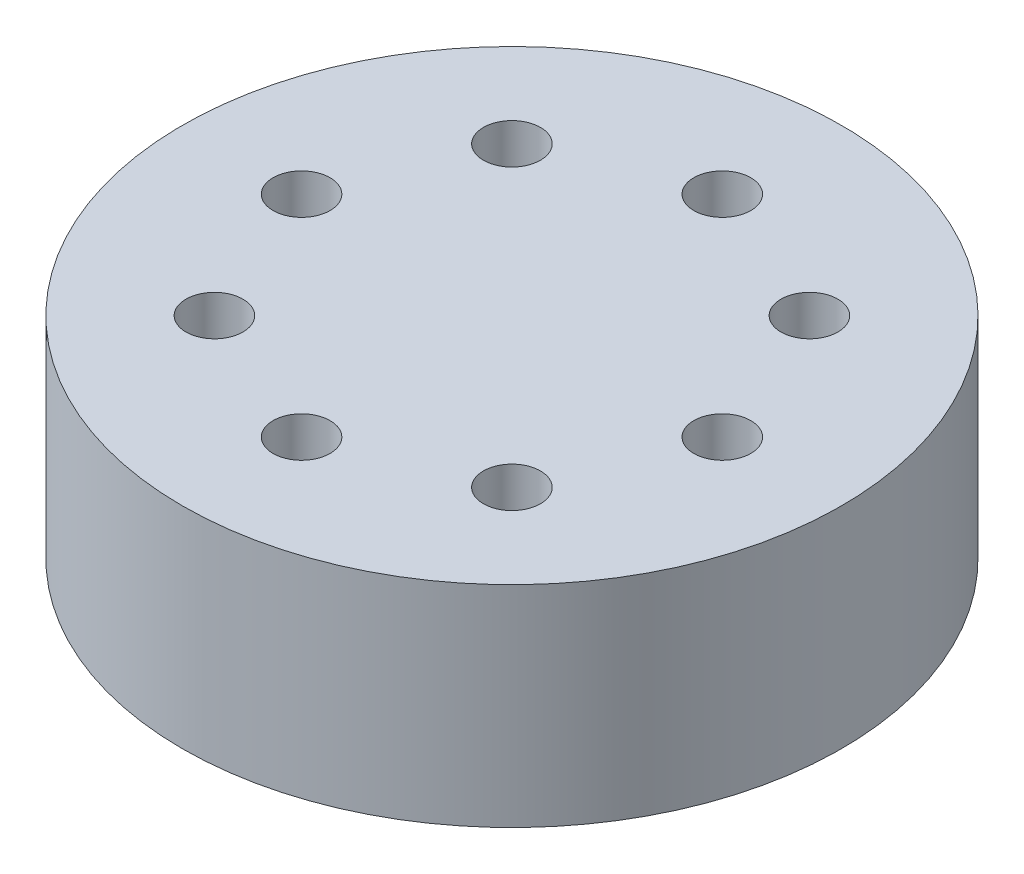
ISO-10303-21;
HEADER;
FILE_DESCRIPTION(('STEP AP214'),'2;1');
FILE_NAME('part.step','',(''),(''),'','','');
FILE_SCHEMA(('AUTOMOTIVE_DESIGN { 1 0 10303 214 1 1 1 1 }'));
ENDSEC;
DATA;
#1=APPLICATION_CONTEXT('core data for automotive mechanical design processes');
#2=APPLICATION_PROTOCOL_DEFINITION('international standard','automotive_design',2000,#1);
#3=PRODUCT_CONTEXT('',#1,'mechanical');
#4=PRODUCT('Part','Part','',(#3));
#5=PRODUCT_RELATED_PRODUCT_CATEGORY('part','',(#4));
#6=PRODUCT_DEFINITION_FORMATION('','',#4);
#7=PRODUCT_DEFINITION_CONTEXT('part definition',#1,'design');
#8=PRODUCT_DEFINITION('design','',#6,#7);
#9=PRODUCT_DEFINITION_SHAPE('','',#8);
#10=(LENGTH_UNIT() NAMED_UNIT(*) SI_UNIT(.MILLI.,.METRE.));
#11=(NAMED_UNIT(*) PLANE_ANGLE_UNIT() SI_UNIT($,.RADIAN.));
#12=(NAMED_UNIT(*) SI_UNIT($,.STERADIAN.) SOLID_ANGLE_UNIT());
#13=UNCERTAINTY_MEASURE_WITH_UNIT(LENGTH_MEASURE(1.E-05),#10,'distance_accuracy_value','');
#14=(GEOMETRIC_REPRESENTATION_CONTEXT(3) GLOBAL_UNCERTAINTY_ASSIGNED_CONTEXT((#13)) GLOBAL_UNIT_ASSIGNED_CONTEXT((#10,
#11,#12)) REPRESENTATION_CONTEXT('',''));
#15=CARTESIAN_POINT('',(0.,0.,0.));
#16=DIRECTION('',(0.,0.,1.));
#17=DIRECTION('',(1.,0.,0.));
#18=AXIS2_PLACEMENT_3D('',#15,#16,#17);
#19=CARTESIAN_POINT('',(0.,1.5,0.));
#20=DIRECTION('',(0.,1.,0.));
#21=DIRECTION('',(0.,0.,1.));
#22=AXIS2_PLACEMENT_3D('',#19,#20,#21);
#23=PLANE('',#22);
#24=CARTESIAN_POINT('',(-1.5,1.5,0.));
#25=DIRECTION('',(0.,1.,0.));
#26=DIRECTION('',(0.,0.,1.));
#27=AXIS2_PLACEMENT_3D('',#24,#25,#26);
#28=CIRCLE('',#27,0.2032);
#29=CARTESIAN_POINT('',(-1.5,1.5,0.2032));
#30=VERTEX_POINT('',#29);
#31=EDGE_CURVE('E78',#30,#30,#28,.T.);
#32=ORIENTED_EDGE('',*,*,#31,.F.);
#33=EDGE_LOOP('',(#32));
#34=FACE_BOUND('',#33,.T.);
#35=CARTESIAN_POINT('',(0.,1.5,1.5));
#36=DIRECTION('',(0.,1.,0.));
#37=DIRECTION('',(0.,0.,1.));
#38=AXIS2_PLACEMENT_3D('',#35,#36,#37);
#39=CIRCLE('',#38,0.2032);
#40=CARTESIAN_POINT('',(0.,1.5,1.7032));
#41=VERTEX_POINT('',#40);
#42=EDGE_CURVE('E66',#41,#41,#39,.T.);
#43=ORIENTED_EDGE('',*,*,#42,.F.);
#44=EDGE_LOOP('',(#43));
#45=FACE_BOUND('',#44,.T.);
#46=CARTESIAN_POINT('',(1.5,1.5,0.));
#47=DIRECTION('',(0.,1.,0.));
#48=DIRECTION('',(0.,0.,1.));
#49=AXIS2_PLACEMENT_3D('',#46,#47,#48);
#50=CIRCLE('',#49,0.2032);
#51=CARTESIAN_POINT('',(1.5,1.5,0.2032));
#52=VERTEX_POINT('',#51);
#53=EDGE_CURVE('E54',#52,#52,#50,.T.);
#54=ORIENTED_EDGE('',*,*,#53,.F.);
#55=EDGE_LOOP('',(#54));
#56=FACE_BOUND('',#55,.T.);
#57=CARTESIAN_POINT('',(0.,1.5,-1.5));
#58=DIRECTION('',(0.,1.,0.));
#59=DIRECTION('',(0.,0.,1.));
#60=AXIS2_PLACEMENT_3D('',#57,#58,#59);
#61=CIRCLE('',#60,0.2032);
#62=CARTESIAN_POINT('',(0.,1.5,-1.2968));
#63=VERTEX_POINT('',#62);
#64=EDGE_CURVE('E43',#63,#63,#61,.T.);
#65=ORIENTED_EDGE('',*,*,#64,.F.);
#66=EDGE_LOOP('',(#65));
#67=FACE_BOUND('',#66,.T.);
#68=CARTESIAN_POINT('',(0.,1.5,0.));
#69=DIRECTION('',(0.,1.,0.));
#70=DIRECTION('',(0.,0.,1.));
#71=AXIS2_PLACEMENT_3D('',#68,#69,#70);
#72=CIRCLE('',#71,2.35);
#73=CARTESIAN_POINT('',(0.,1.5,2.35));
#74=VERTEX_POINT('',#73);
#75=EDGE_CURVE('E10',#74,#74,#72,.T.);
#76=ORIENTED_EDGE('',*,*,#75,.T.);
#77=EDGE_LOOP('',(#76));
#78=FACE_BOUND('',#77,.T.);
#79=CARTESIAN_POINT('',(1.06066017177982,1.5,-1.06066017177982));
#80=DIRECTION('',(0.,1.,0.));
#81=DIRECTION('',(0.,0.,1.));
#82=AXIS2_PLACEMENT_3D('',#79,#80,#81);
#83=CIRCLE('',#82,0.2032);
#84=CARTESIAN_POINT('',(1.06066017177982,1.5,-0.857460171779821));
#85=VERTEX_POINT('',#84);
#86=EDGE_CURVE('E48',#85,#85,#83,.T.);
#87=ORIENTED_EDGE('',*,*,#86,.F.);
#88=EDGE_LOOP('',(#87));
#89=FACE_BOUND('',#88,.T.);
#90=CARTESIAN_POINT('',(1.06066017177982,1.5,1.06066017177982));
#91=DIRECTION('',(0.,1.,0.));
#92=DIRECTION('',(0.,0.,1.));
#93=AXIS2_PLACEMENT_3D('',#90,#91,#92);
#94=CIRCLE('',#93,0.2032);
#95=CARTESIAN_POINT('',(1.06066017177982,1.5,1.26386017177982));
#96=VERTEX_POINT('',#95);
#97=EDGE_CURVE('E60',#96,#96,#94,.T.);
#98=ORIENTED_EDGE('',*,*,#97,.F.);
#99=EDGE_LOOP('',(#98));
#100=FACE_BOUND('',#99,.T.);
#101=CARTESIAN_POINT('',(-1.06066017177982,1.5,1.06066017177982));
#102=DIRECTION('',(0.,1.,0.));
#103=DIRECTION('',(0.,0.,1.));
#104=AXIS2_PLACEMENT_3D('',#101,#102,#103);
#105=CIRCLE('',#104,0.2032);
#106=CARTESIAN_POINT('',(-1.06066017177982,1.5,1.26386017177982));
#107=VERTEX_POINT('',#106);
#108=EDGE_CURVE('E72',#107,#107,#105,.T.);
#109=ORIENTED_EDGE('',*,*,#108,.F.);
#110=EDGE_LOOP('',(#109));
#111=FACE_BOUND('',#110,.T.);
#112=CARTESIAN_POINT('',(-1.06066017177982,1.5,-1.06066017177982));
#113=DIRECTION('',(0.,1.,0.));
#114=DIRECTION('',(0.,0.,1.));
#115=AXIS2_PLACEMENT_3D('',#112,#113,#114);
#116=CIRCLE('',#115,0.2032);
#117=CARTESIAN_POINT('',(-1.06066017177982,1.5,-0.857460171779821));
#118=VERTEX_POINT('',#117);
#119=EDGE_CURVE('E84',#118,#118,#116,.T.);
#120=ORIENTED_EDGE('',*,*,#119,.F.);
#121=EDGE_LOOP('',(#120));
#122=FACE_BOUND('',#121,.T.);
#123=ADVANCED_FACE('F32',(#34,#45,#56,#67,#78,#89,#100,#111,#122),#23,.T.);
#124=CARTESIAN_POINT('',(0.,0.,0.));
#125=DIRECTION('',(0.,1.,0.));
#126=DIRECTION('',(0.,0.,1.));
#127=AXIS2_PLACEMENT_3D('',#124,#125,#126);
#128=PLANE('',#127);
#129=CARTESIAN_POINT('',(0.,0.,0.));
#130=DIRECTION('',(0.,1.,0.));
#131=DIRECTION('',(0.,0.,1.));
#132=AXIS2_PLACEMENT_3D('',#129,#130,#131);
#133=CIRCLE('',#132,2.35);
#134=CARTESIAN_POINT('',(0.,0.,2.35));
#135=VERTEX_POINT('',#134);
#136=EDGE_CURVE('E36',#135,#135,#133,.T.);
#137=ORIENTED_EDGE('',*,*,#136,.F.);
#138=EDGE_LOOP('',(#137));
#139=FACE_BOUND('',#138,.T.);
#140=CARTESIAN_POINT('',(0.,0.,-1.5));
#141=DIRECTION('',(0.,1.,0.));
#142=DIRECTION('',(0.,0.,1.));
#143=AXIS2_PLACEMENT_3D('',#140,#141,#142);
#144=CIRCLE('',#143,0.2032);
#145=CARTESIAN_POINT('',(0.,0.,-1.2968));
#146=VERTEX_POINT('',#145);
#147=EDGE_CURVE('E45',#146,#146,#144,.T.);
#148=ORIENTED_EDGE('',*,*,#147,.T.);
#149=EDGE_LOOP('',(#148));
#150=FACE_BOUND('',#149,.T.);
#151=CARTESIAN_POINT('',(1.06066017177982,0.,-1.06066017177982));
#152=DIRECTION('',(0.,1.,0.));
#153=DIRECTION('',(0.,0.,1.));
#154=AXIS2_PLACEMENT_3D('',#151,#152,#153);
#155=CIRCLE('',#154,0.2032);
#156=CARTESIAN_POINT('',(1.06066017177982,0.,-0.857460171779821));
#157=VERTEX_POINT('',#156);
#158=EDGE_CURVE('E51',#157,#157,#155,.T.);
#159=ORIENTED_EDGE('',*,*,#158,.T.);
#160=EDGE_LOOP('',(#159));
#161=FACE_BOUND('',#160,.T.);
#162=CARTESIAN_POINT('',(1.5,0.,0.));
#163=DIRECTION('',(0.,1.,0.));
#164=DIRECTION('',(0.,0.,1.));
#165=AXIS2_PLACEMENT_3D('',#162,#163,#164);
#166=CIRCLE('',#165,0.2032);
#167=CARTESIAN_POINT('',(1.5,0.,0.2032));
#168=VERTEX_POINT('',#167);
#169=EDGE_CURVE('E57',#168,#168,#166,.T.);
#170=ORIENTED_EDGE('',*,*,#169,.T.);
#171=EDGE_LOOP('',(#170));
#172=FACE_BOUND('',#171,.T.);
#173=CARTESIAN_POINT('',(1.06066017177982,0.,1.06066017177982));
#174=DIRECTION('',(0.,1.,0.));
#175=DIRECTION('',(0.,0.,1.));
#176=AXIS2_PLACEMENT_3D('',#173,#174,#175);
#177=CIRCLE('',#176,0.2032);
#178=CARTESIAN_POINT('',(1.06066017177982,0.,1.26386017177982));
#179=VERTEX_POINT('',#178);
#180=EDGE_CURVE('E63',#179,#179,#177,.T.);
#181=ORIENTED_EDGE('',*,*,#180,.T.);
#182=EDGE_LOOP('',(#181));
#183=FACE_BOUND('',#182,.T.);
#184=CARTESIAN_POINT('',(0.,0.,1.5));
#185=DIRECTION('',(0.,1.,0.));
#186=DIRECTION('',(0.,0.,1.));
#187=AXIS2_PLACEMENT_3D('',#184,#185,#186);
#188=CIRCLE('',#187,0.2032);
#189=CARTESIAN_POINT('',(0.,0.,1.7032));
#190=VERTEX_POINT('',#189);
#191=EDGE_CURVE('E69',#190,#190,#188,.T.);
#192=ORIENTED_EDGE('',*,*,#191,.T.);
#193=EDGE_LOOP('',(#192));
#194=FACE_BOUND('',#193,.T.);
#195=CARTESIAN_POINT('',(-1.06066017177982,0.,1.06066017177982));
#196=DIRECTION('',(0.,1.,0.));
#197=DIRECTION('',(0.,0.,1.));
#198=AXIS2_PLACEMENT_3D('',#195,#196,#197);
#199=CIRCLE('',#198,0.2032);
#200=CARTESIAN_POINT('',(-1.06066017177982,0.,1.26386017177982));
#201=VERTEX_POINT('',#200);
#202=EDGE_CURVE('E75',#201,#201,#199,.T.);
#203=ORIENTED_EDGE('',*,*,#202,.T.);
#204=EDGE_LOOP('',(#203));
#205=FACE_BOUND('',#204,.T.);
#206=CARTESIAN_POINT('',(-1.5,0.,0.));
#207=DIRECTION('',(0.,1.,0.));
#208=DIRECTION('',(0.,0.,1.));
#209=AXIS2_PLACEMENT_3D('',#206,#207,#208);
#210=CIRCLE('',#209,0.2032);
#211=CARTESIAN_POINT('',(-1.5,0.,0.2032));
#212=VERTEX_POINT('',#211);
#213=EDGE_CURVE('E81',#212,#212,#210,.T.);
#214=ORIENTED_EDGE('',*,*,#213,.T.);
#215=EDGE_LOOP('',(#214));
#216=FACE_BOUND('',#215,.T.);
#217=CARTESIAN_POINT('',(-1.06066017177982,0.,-1.06066017177982));
#218=DIRECTION('',(0.,1.,0.));
#219=DIRECTION('',(0.,0.,1.));
#220=AXIS2_PLACEMENT_3D('',#217,#218,#219);
#221=CIRCLE('',#220,0.2032);
#222=CARTESIAN_POINT('',(-1.06066017177982,0.,-0.857460171779821));
#223=VERTEX_POINT('',#222);
#224=EDGE_CURVE('E87',#223,#223,#221,.T.);
#225=ORIENTED_EDGE('',*,*,#224,.T.);
#226=EDGE_LOOP('',(#225));
#227=FACE_BOUND('',#226,.T.);
#228=ADVANCED_FACE('F97',(#139,#150,#161,#172,#183,#194,#205,#216,#227),#128,.F.);
#229=CARTESIAN_POINT('',(0.,1.5,0.));
#230=DIRECTION('',(0.,-1.,0.));
#231=DIRECTION('',(0.,0.,-1.));
#232=AXIS2_PLACEMENT_3D('',#229,#230,#231);
#233=CYLINDRICAL_SURFACE('',#232,2.35);
#234=ORIENTED_EDGE('',*,*,#75,.F.);
#235=EDGE_LOOP('',(#234));
#236=FACE_BOUND('',#235,.T.);
#237=ORIENTED_EDGE('',*,*,#136,.T.);
#238=EDGE_LOOP('',(#237));
#239=FACE_BOUND('',#238,.T.);
#240=ADVANCED_FACE('F34',(#236,#239),#233,.T.);
#241=CARTESIAN_POINT('',(0.,1.5,-1.5));
#242=DIRECTION('',(0.,-1.,0.));
#243=DIRECTION('',(0.,0.,-1.));
#244=AXIS2_PLACEMENT_3D('',#241,#242,#243);
#245=CYLINDRICAL_SURFACE('',#244,0.2032);
#246=ORIENTED_EDGE('',*,*,#64,.T.);
#247=EDGE_LOOP('',(#246));
#248=FACE_BOUND('',#247,.T.);
#249=ORIENTED_EDGE('',*,*,#147,.F.);
#250=EDGE_LOOP('',(#249));
#251=FACE_BOUND('',#250,.T.);
#252=ADVANCED_FACE('F107',(#248,#251),#245,.F.);
#253=CARTESIAN_POINT('',(1.06066017177982,1.5,-1.06066017177982));
#254=DIRECTION('',(0.,-1.,0.));
#255=DIRECTION('',(0.,0.,-1.));
#256=AXIS2_PLACEMENT_3D('',#253,#254,#255);
#257=CYLINDRICAL_SURFACE('',#256,0.2032);
#258=ORIENTED_EDGE('',*,*,#86,.T.);
#259=EDGE_LOOP('',(#258));
#260=FACE_BOUND('',#259,.T.);
#261=ORIENTED_EDGE('',*,*,#158,.F.);
#262=EDGE_LOOP('',(#261));
#263=FACE_BOUND('',#262,.T.);
#264=ADVANCED_FACE('F110',(#260,#263),#257,.F.);
#265=CARTESIAN_POINT('',(1.5,1.5,0.));
#266=DIRECTION('',(0.,-1.,0.));
#267=DIRECTION('',(0.,0.,-1.));
#268=AXIS2_PLACEMENT_3D('',#265,#266,#267);
#269=CYLINDRICAL_SURFACE('',#268,0.2032);
#270=ORIENTED_EDGE('',*,*,#53,.T.);
#271=EDGE_LOOP('',(#270));
#272=FACE_BOUND('',#271,.T.);
#273=ORIENTED_EDGE('',*,*,#169,.F.);
#274=EDGE_LOOP('',(#273));
#275=FACE_BOUND('',#274,.T.);
#276=ADVANCED_FACE('F114',(#272,#275),#269,.F.);
#277=CARTESIAN_POINT('',(1.06066017177982,1.5,1.06066017177982));
#278=DIRECTION('',(0.,-1.,0.));
#279=DIRECTION('',(0.,0.,-1.));
#280=AXIS2_PLACEMENT_3D('',#277,#278,#279);
#281=CYLINDRICAL_SURFACE('',#280,0.2032);
#282=ORIENTED_EDGE('',*,*,#97,.T.);
#283=EDGE_LOOP('',(#282));
#284=FACE_BOUND('',#283,.T.);
#285=ORIENTED_EDGE('',*,*,#180,.F.);
#286=EDGE_LOOP('',(#285));
#287=FACE_BOUND('',#286,.T.);
#288=ADVANCED_FACE('F118',(#284,#287),#281,.F.);
#289=CARTESIAN_POINT('',(0.,1.5,1.5));
#290=DIRECTION('',(0.,-1.,0.));
#291=DIRECTION('',(0.,0.,-1.));
#292=AXIS2_PLACEMENT_3D('',#289,#290,#291);
#293=CYLINDRICAL_SURFACE('',#292,0.2032);
#294=ORIENTED_EDGE('',*,*,#42,.T.);
#295=EDGE_LOOP('',(#294));
#296=FACE_BOUND('',#295,.T.);
#297=ORIENTED_EDGE('',*,*,#191,.F.);
#298=EDGE_LOOP('',(#297));
#299=FACE_BOUND('',#298,.T.);
#300=ADVANCED_FACE('F122',(#296,#299),#293,.F.);
#301=CARTESIAN_POINT('',(-1.06066017177982,1.5,1.06066017177982));
#302=DIRECTION('',(0.,-1.,0.));
#303=DIRECTION('',(0.,0.,-1.));
#304=AXIS2_PLACEMENT_3D('',#301,#302,#303);
#305=CYLINDRICAL_SURFACE('',#304,0.2032);
#306=ORIENTED_EDGE('',*,*,#108,.T.);
#307=EDGE_LOOP('',(#306));
#308=FACE_BOUND('',#307,.T.);
#309=ORIENTED_EDGE('',*,*,#202,.F.);
#310=EDGE_LOOP('',(#309));
#311=FACE_BOUND('',#310,.T.);
#312=ADVANCED_FACE('F126',(#308,#311),#305,.F.);
#313=CARTESIAN_POINT('',(-1.5,1.5,0.));
#314=DIRECTION('',(0.,-1.,0.));
#315=DIRECTION('',(0.,0.,-1.));
#316=AXIS2_PLACEMENT_3D('',#313,#314,#315);
#317=CYLINDRICAL_SURFACE('',#316,0.2032);
#318=ORIENTED_EDGE('',*,*,#31,.T.);
#319=EDGE_LOOP('',(#318));
#320=FACE_BOUND('',#319,.T.);
#321=ORIENTED_EDGE('',*,*,#213,.F.);
#322=EDGE_LOOP('',(#321));
#323=FACE_BOUND('',#322,.T.);
#324=ADVANCED_FACE('F130',(#320,#323),#317,.F.);
#325=CARTESIAN_POINT('',(-1.06066017177982,1.5,-1.06066017177982));
#326=DIRECTION('',(0.,-1.,0.));
#327=DIRECTION('',(0.,0.,-1.));
#328=AXIS2_PLACEMENT_3D('',#325,#326,#327);
#329=CYLINDRICAL_SURFACE('',#328,0.2032);
#330=ORIENTED_EDGE('',*,*,#119,.T.);
#331=EDGE_LOOP('',(#330));
#332=FACE_BOUND('',#331,.T.);
#333=ORIENTED_EDGE('',*,*,#224,.F.);
#334=EDGE_LOOP('',(#333));
#335=FACE_BOUND('',#334,.T.);
#336=ADVANCED_FACE('F93',(#332,#335),#329,.F.);
#337=CLOSED_SHELL('',(#123,#228,#240,#252,#264,#276,#288,#300,#312,#324,#336));
#338=MANIFOLD_SOLID_BREP('B2',#337);
#339=ADVANCED_BREP_SHAPE_REPRESENTATION('',(#18,#338),#14);
#340=SHAPE_DEFINITION_REPRESENTATION(#9,#339);
ENDSEC;
END-ISO-10303-21;
